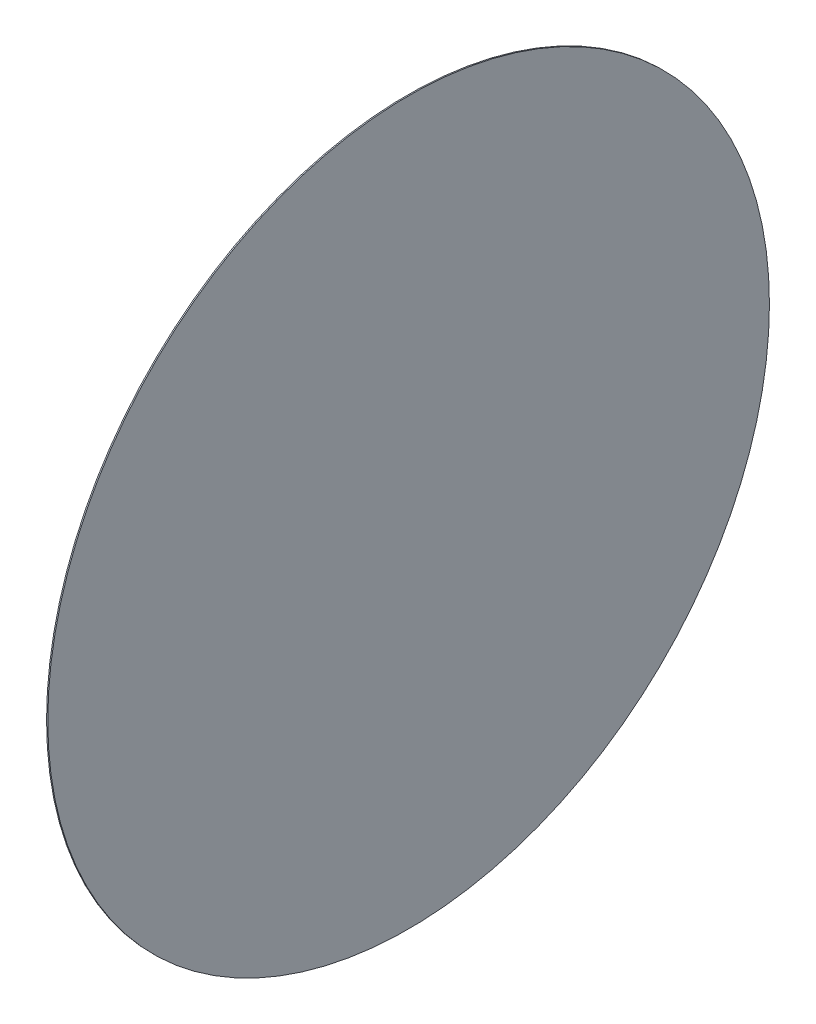
ISO-10303-21;
HEADER;
FILE_DESCRIPTION(('STEP AP214'),'2;1');
FILE_NAME('part.step','',(''),(''),'','','');
FILE_SCHEMA(('AUTOMOTIVE_DESIGN { 1 0 10303 214 1 1 1 1 }'));
ENDSEC;
DATA;
#1=APPLICATION_CONTEXT('core data for automotive mechanical design processes');
#2=APPLICATION_PROTOCOL_DEFINITION('international standard','automotive_design',2000,#1);
#3=PRODUCT_CONTEXT('',#1,'mechanical');
#4=PRODUCT('Part','Part','',(#3));
#5=PRODUCT_RELATED_PRODUCT_CATEGORY('part','',(#4));
#6=PRODUCT_DEFINITION_FORMATION('','',#4);
#7=PRODUCT_DEFINITION_CONTEXT('part definition',#1,'design');
#8=PRODUCT_DEFINITION('design','',#6,#7);
#9=PRODUCT_DEFINITION_SHAPE('','',#8);
#10=(LENGTH_UNIT() NAMED_UNIT(*) SI_UNIT(.MILLI.,.METRE.));
#11=(NAMED_UNIT(*) PLANE_ANGLE_UNIT() SI_UNIT($,.RADIAN.));
#12=(NAMED_UNIT(*) SI_UNIT($,.STERADIAN.) SOLID_ANGLE_UNIT());
#13=UNCERTAINTY_MEASURE_WITH_UNIT(LENGTH_MEASURE(1.E-05),#10,'distance_accuracy_value','');
#14=(GEOMETRIC_REPRESENTATION_CONTEXT(3) GLOBAL_UNCERTAINTY_ASSIGNED_CONTEXT((#13)) GLOBAL_UNIT_ASSIGNED_CONTEXT((#10,
#11,#12)) REPRESENTATION_CONTEXT('',''));
#15=CARTESIAN_POINT('',(0.,0.,0.));
#16=DIRECTION('',(0.,0.,1.));
#17=DIRECTION('',(1.,0.,0.));
#18=AXIS2_PLACEMENT_3D('',#15,#16,#17);
#19=CARTESIAN_POINT('',(0.,0.,0.));
#20=DIRECTION('',(-1.,0.,0.));
#21=DIRECTION('',(0.,0.,1.));
#22=AXIS2_PLACEMENT_3D('',#19,#20,#21);
#23=CYLINDRICAL_SURFACE('',#22,9.);
#24=CARTESIAN_POINT('',(0.,0.,0.));
#25=DIRECTION('',(-1.,0.,0.));
#26=DIRECTION('',(0.,0.,1.));
#27=AXIS2_PLACEMENT_3D('',#24,#25,#26);
#28=CIRCLE('',#27,9.);
#29=CARTESIAN_POINT('',(0.,0.,9.));
#30=VERTEX_POINT('',#29);
#31=EDGE_CURVE('E44',#30,#30,#28,.T.);
#32=ORIENTED_EDGE('',*,*,#31,.F.);
#33=EDGE_LOOP('',(#32));
#34=FACE_BOUND('',#33,.T.);
#35=CARTESIAN_POINT('',(0.0299999999999988,0.,0.));
#36=DIRECTION('',(-1.,0.,0.));
#37=DIRECTION('',(0.,0.,1.));
#38=AXIS2_PLACEMENT_3D('',#35,#36,#37);
#39=CIRCLE('',#38,9.);
#40=CARTESIAN_POINT('',(0.0299999999999988,0.,9.));
#41=VERTEX_POINT('',#40);
#42=EDGE_CURVE('E10',#41,#41,#39,.T.);
#43=ORIENTED_EDGE('',*,*,#42,.T.);
#44=EDGE_LOOP('',(#43));
#45=FACE_BOUND('',#44,.T.);
#46=ADVANCED_FACE('F37',(#34,#45),#23,.T.);
#47=CARTESIAN_POINT('',(0.0299999999999994,9.,0.));
#48=DIRECTION('',(-1.,0.,0.));
#49=DIRECTION('',(0.,0.,1.));
#50=AXIS2_PLACEMENT_3D('',#47,#48,#49);
#51=PLANE('',#50);
#52=ORIENTED_EDGE('',*,*,#42,.F.);
#53=EDGE_LOOP('',(#52));
#54=FACE_BOUND('',#53,.T.);
#55=ADVANCED_FACE('F54',(#54),#51,.F.);
#56=CARTESIAN_POINT('',(0.,9.,0.));
#57=DIRECTION('',(1.,0.,0.));
#58=DIRECTION('',(0.,0.,-1.));
#59=AXIS2_PLACEMENT_3D('',#56,#57,#58);
#60=PLANE('',#59);
#61=ORIENTED_EDGE('',*,*,#31,.T.);
#62=EDGE_LOOP('',(#61));
#63=FACE_BOUND('',#62,.T.);
#64=ADVANCED_FACE('F51',(#63),#60,.F.);
#65=CLOSED_SHELL('',(#46,#55,#64));
#66=MANIFOLD_SOLID_BREP('B2',#65);
#67=ADVANCED_BREP_SHAPE_REPRESENTATION('',(#18,#66),#14);
#68=SHAPE_DEFINITION_REPRESENTATION(#9,#67);
ENDSEC;
END-ISO-10303-21;
